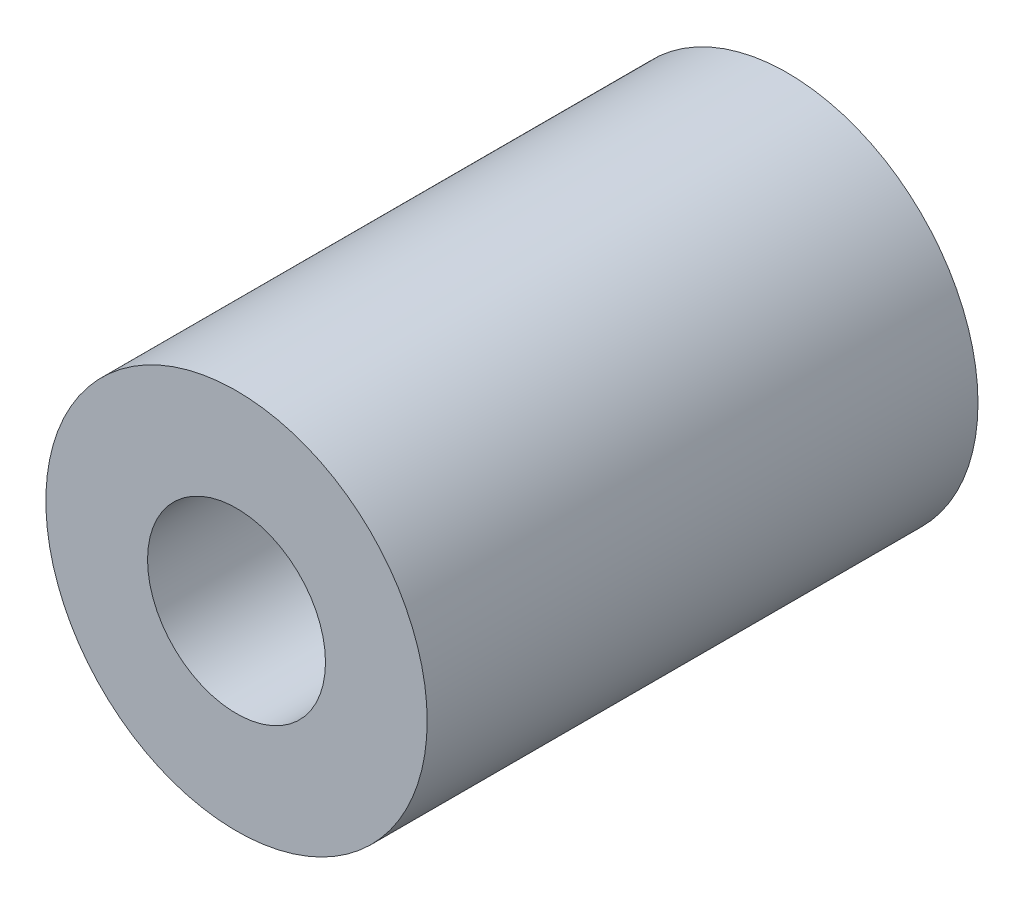
ISO-10303-21;
HEADER;
FILE_DESCRIPTION(('STEP AP214'),'2;1');
FILE_NAME('part.step','',(''),(''),'','','');
FILE_SCHEMA(('AUTOMOTIVE_DESIGN { 1 0 10303 214 1 1 1 1 }'));
ENDSEC;
DATA;
#1=APPLICATION_CONTEXT('core data for automotive mechanical design processes');
#2=APPLICATION_PROTOCOL_DEFINITION('international standard','automotive_design',2000,#1);
#3=PRODUCT_CONTEXT('',#1,'mechanical');
#4=PRODUCT('Part','Part','',(#3));
#5=PRODUCT_RELATED_PRODUCT_CATEGORY('part','',(#4));
#6=PRODUCT_DEFINITION_FORMATION('','',#4);
#7=PRODUCT_DEFINITION_CONTEXT('part definition',#1,'design');
#8=PRODUCT_DEFINITION('design','',#6,#7);
#9=PRODUCT_DEFINITION_SHAPE('','',#8);
#10=(LENGTH_UNIT() NAMED_UNIT(*) SI_UNIT(.MILLI.,.METRE.));
#11=(NAMED_UNIT(*) PLANE_ANGLE_UNIT() SI_UNIT($,.RADIAN.));
#12=(NAMED_UNIT(*) SI_UNIT($,.STERADIAN.) SOLID_ANGLE_UNIT());
#13=UNCERTAINTY_MEASURE_WITH_UNIT(LENGTH_MEASURE(1.E-05),#10,'distance_accuracy_value','');
#14=(GEOMETRIC_REPRESENTATION_CONTEXT(3) GLOBAL_UNCERTAINTY_ASSIGNED_CONTEXT((#13)) GLOBAL_UNIT_ASSIGNED_CONTEXT((#10,
#11,#12)) REPRESENTATION_CONTEXT('',''));
#15=CARTESIAN_POINT('',(0.,0.,0.));
#16=DIRECTION('',(0.,0.,1.));
#17=DIRECTION('',(1.,0.,0.));
#18=AXIS2_PLACEMENT_3D('',#15,#16,#17);
#19=CARTESIAN_POINT('',(0.,0.,26.));
#20=DIRECTION('',(0.,0.,1.));
#21=DIRECTION('',(1.,0.,0.));
#22=AXIS2_PLACEMENT_3D('',#19,#20,#21);
#23=PLANE('',#22);
#24=CARTESIAN_POINT('',(0.,0.,26.));
#25=DIRECTION('',(0.,0.,1.));
#26=DIRECTION('',(1.,0.,0.));
#27=AXIS2_PLACEMENT_3D('',#24,#25,#26);
#28=CIRCLE('',#27,9.);
#29=CARTESIAN_POINT('',(9.,0.,26.));
#30=VERTEX_POINT('',#29);
#31=EDGE_CURVE('E10',#30,#30,#28,.T.);
#32=ORIENTED_EDGE('',*,*,#31,.T.);
#33=EDGE_LOOP('',(#32));
#34=FACE_BOUND('',#33,.T.);
#35=CARTESIAN_POINT('',(0.,0.,26.));
#36=DIRECTION('',(0.,0.,1.));
#37=DIRECTION('',(1.,0.,0.));
#38=AXIS2_PLACEMENT_3D('',#35,#36,#37);
#39=CIRCLE('',#38,4.2);
#40=CARTESIAN_POINT('',(4.2,0.,26.));
#41=VERTEX_POINT('',#40);
#42=EDGE_CURVE('E42',#41,#41,#39,.T.);
#43=ORIENTED_EDGE('',*,*,#42,.F.);
#44=EDGE_LOOP('',(#43));
#45=FACE_BOUND('',#44,.T.);
#46=ADVANCED_FACE('F31',(#34,#45),#23,.T.);
#47=CARTESIAN_POINT('',(0.,0.,0.));
#48=DIRECTION('',(0.,0.,1.));
#49=DIRECTION('',(1.,0.,0.));
#50=AXIS2_PLACEMENT_3D('',#47,#48,#49);
#51=PLANE('',#50);
#52=CARTESIAN_POINT('',(0.,0.,0.));
#53=DIRECTION('',(0.,0.,1.));
#54=DIRECTION('',(1.,0.,0.));
#55=AXIS2_PLACEMENT_3D('',#52,#53,#54);
#56=CIRCLE('',#55,9.);
#57=CARTESIAN_POINT('',(9.,0.,0.));
#58=VERTEX_POINT('',#57);
#59=EDGE_CURVE('E35',#58,#58,#56,.T.);
#60=ORIENTED_EDGE('',*,*,#59,.F.);
#61=EDGE_LOOP('',(#60));
#62=FACE_BOUND('',#61,.T.);
#63=CARTESIAN_POINT('',(0.,0.,0.));
#64=DIRECTION('',(0.,0.,1.));
#65=DIRECTION('',(1.,0.,0.));
#66=AXIS2_PLACEMENT_3D('',#63,#64,#65);
#67=CIRCLE('',#66,4.2);
#68=CARTESIAN_POINT('',(4.2,0.,0.));
#69=VERTEX_POINT('',#68);
#70=EDGE_CURVE('E44',#69,#69,#67,.T.);
#71=ORIENTED_EDGE('',*,*,#70,.T.);
#72=EDGE_LOOP('',(#71));
#73=FACE_BOUND('',#72,.T.);
#74=ADVANCED_FACE('F54',(#62,#73),#51,.F.);
#75=CARTESIAN_POINT('',(0.,0.,26.));
#76=DIRECTION('',(0.,0.,-1.));
#77=DIRECTION('',(-1.,0.,0.));
#78=AXIS2_PLACEMENT_3D('',#75,#76,#77);
#79=CYLINDRICAL_SURFACE('',#78,9.);
#80=ORIENTED_EDGE('',*,*,#31,.F.);
#81=EDGE_LOOP('',(#80));
#82=FACE_BOUND('',#81,.T.);
#83=ORIENTED_EDGE('',*,*,#59,.T.);
#84=EDGE_LOOP('',(#83));
#85=FACE_BOUND('',#84,.T.);
#86=ADVANCED_FACE('F33',(#82,#85),#79,.T.);
#87=CARTESIAN_POINT('',(0.,0.,26.));
#88=DIRECTION('',(0.,0.,-1.));
#89=DIRECTION('',(-1.,0.,0.));
#90=AXIS2_PLACEMENT_3D('',#87,#88,#89);
#91=CYLINDRICAL_SURFACE('',#90,4.2);
#92=ORIENTED_EDGE('',*,*,#42,.T.);
#93=EDGE_LOOP('',(#92));
#94=FACE_BOUND('',#93,.T.);
#95=ORIENTED_EDGE('',*,*,#70,.F.);
#96=EDGE_LOOP('',(#95));
#97=FACE_BOUND('',#96,.T.);
#98=ADVANCED_FACE('F50',(#94,#97),#91,.F.);
#99=CLOSED_SHELL('',(#46,#74,#86,#98));
#100=MANIFOLD_SOLID_BREP('B2',#99);
#101=ADVANCED_BREP_SHAPE_REPRESENTATION('',(#18,#100),#14);
#102=SHAPE_DEFINITION_REPRESENTATION(#9,#101);
ENDSEC;
END-ISO-10303-21;
